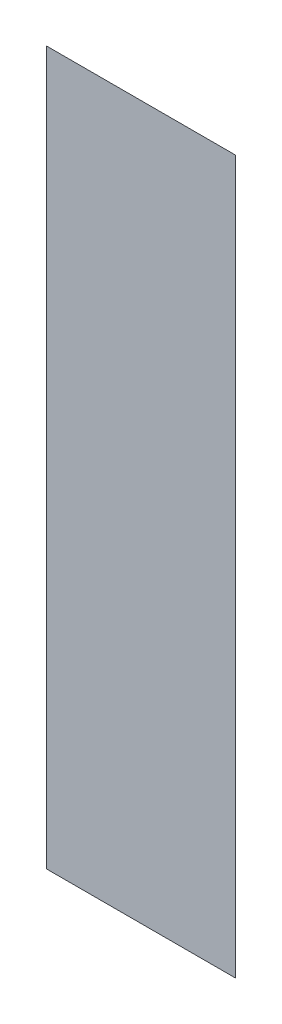
ISO-10303-21;
HEADER;
FILE_DESCRIPTION(('STEP AP214'),'2;1');
FILE_NAME('part.step','',(''),(''),'','','');
FILE_SCHEMA(('AUTOMOTIVE_DESIGN { 1 0 10303 214 1 1 1 1 }'));
ENDSEC;
DATA;
#1=APPLICATION_CONTEXT('core data for automotive mechanical design processes');
#2=APPLICATION_PROTOCOL_DEFINITION('international standard','automotive_design',2000,#1);
#3=PRODUCT_CONTEXT('',#1,'mechanical');
#4=PRODUCT('Part','Part','',(#3));
#5=PRODUCT_RELATED_PRODUCT_CATEGORY('part','',(#4));
#6=PRODUCT_DEFINITION_FORMATION('','',#4);
#7=PRODUCT_DEFINITION_CONTEXT('part definition',#1,'design');
#8=PRODUCT_DEFINITION('design','',#6,#7);
#9=PRODUCT_DEFINITION_SHAPE('','',#8);
#10=(LENGTH_UNIT() NAMED_UNIT(*) SI_UNIT(.MILLI.,.METRE.));
#11=(NAMED_UNIT(*) PLANE_ANGLE_UNIT() SI_UNIT($,.RADIAN.));
#12=(NAMED_UNIT(*) SI_UNIT($,.STERADIAN.) SOLID_ANGLE_UNIT());
#13=UNCERTAINTY_MEASURE_WITH_UNIT(LENGTH_MEASURE(1.E-05),#10,'distance_accuracy_value','');
#14=(GEOMETRIC_REPRESENTATION_CONTEXT(3) GLOBAL_UNCERTAINTY_ASSIGNED_CONTEXT((#13)) GLOBAL_UNIT_ASSIGNED_CONTEXT((#10,
#11,#12)) REPRESENTATION_CONTEXT('',''));
#15=CARTESIAN_POINT('',(0.,0.,0.));
#16=DIRECTION('',(0.,0.,1.));
#17=DIRECTION('',(1.,0.,0.));
#18=AXIS2_PLACEMENT_3D('',#15,#16,#17);
#19=CARTESIAN_POINT('',(-0.539020574947,0.008290420147459,0.0003));
#20=DIRECTION('',(0.,0.,1.));
#21=DIRECTION('',(1.,0.,0.));
#22=AXIS2_PLACEMENT_3D('',#19,#20,#21);
#23=PLANE('',#22);
#24=CARTESIAN_POINT('',(-0.645729163788,-0.394486613319,0.0003));
#25=DIRECTION('',(1.,0.,0.));
#26=VECTOR('',#25,1.);
#27=LINE('',#24,#26);
#28=CARTESIAN_POINT('',(-0.645729163788,-0.394486613319,0.00015));
#29=VERTEX_POINT('',#28);
#30=CARTESIAN_POINT('',(-0.432311986107,-0.394486613319,0.00015));
#31=VERTEX_POINT('',#30);
#32=EDGE_CURVE('E41',#29,#31,#27,.T.);
#33=ORIENTED_EDGE('',*,*,#32,.T.);
#34=CARTESIAN_POINT('',(-0.432311986107,-0.394486613319,0.0003));
#35=DIRECTION('',(0.,1.,0.));
#36=VECTOR('',#35,1.);
#37=LINE('',#34,#36);
#38=CARTESIAN_POINT('',(-0.432311986107,0.411067453614,0.00015));
#39=VERTEX_POINT('',#38);
#40=EDGE_CURVE('E28',#31,#39,#37,.T.);
#41=ORIENTED_EDGE('',*,*,#40,.T.);
#42=CARTESIAN_POINT('',(-0.432311986107,0.411067453614,0.0003));
#43=DIRECTION('',(-1.,0.,0.));
#44=VECTOR('',#43,1.);
#45=LINE('',#42,#44);
#46=CARTESIAN_POINT('',(-0.645729163788,0.411067453614,0.00015));
#47=VERTEX_POINT('',#46);
#48=EDGE_CURVE('E11',#39,#47,#45,.T.);
#49=ORIENTED_EDGE('',*,*,#48,.T.);
#50=CARTESIAN_POINT('',(-0.645729163788,0.411067453614,0.0003));
#51=DIRECTION('',(0.,-1.,0.));
#52=VECTOR('',#51,1.);
#53=LINE('',#50,#52);
#54=EDGE_CURVE('E44',#47,#29,#53,.T.);
#55=ORIENTED_EDGE('',*,*,#54,.T.);
#56=EDGE_LOOP('',(#33,#41,#49,#55));
#57=FACE_BOUND('',#56,.T.);
#58=ADVANCED_FACE('F17',(#57),#23,.T.);
#59=CARTESIAN_POINT('',(-0.539020574947,0.008290420147459,0.));
#60=DIRECTION('',(0.,0.,1.));
#61=DIRECTION('',(1.,0.,0.));
#62=AXIS2_PLACEMENT_3D('',#59,#60,#61);
#63=PLANE('',#62);
#64=ORIENTED_EDGE('',*,*,#40,.F.);
#65=ORIENTED_EDGE('',*,*,#32,.F.);
#66=ORIENTED_EDGE('',*,*,#54,.F.);
#67=ORIENTED_EDGE('',*,*,#48,.F.);
#68=EDGE_LOOP('',(#64,#65,#66,#67));
#69=FACE_BOUND('',#68,.T.);
#70=ADVANCED_FACE('F46',(#69),#63,.F.);
#71=CLOSED_SHELL('',(#58,#70));
#72=MANIFOLD_SOLID_BREP('B1',#71);
#73=ADVANCED_BREP_SHAPE_REPRESENTATION('',(#18,#72),#14);
#74=SHAPE_DEFINITION_REPRESENTATION(#9,#73);
ENDSEC;
END-ISO-10303-21;
